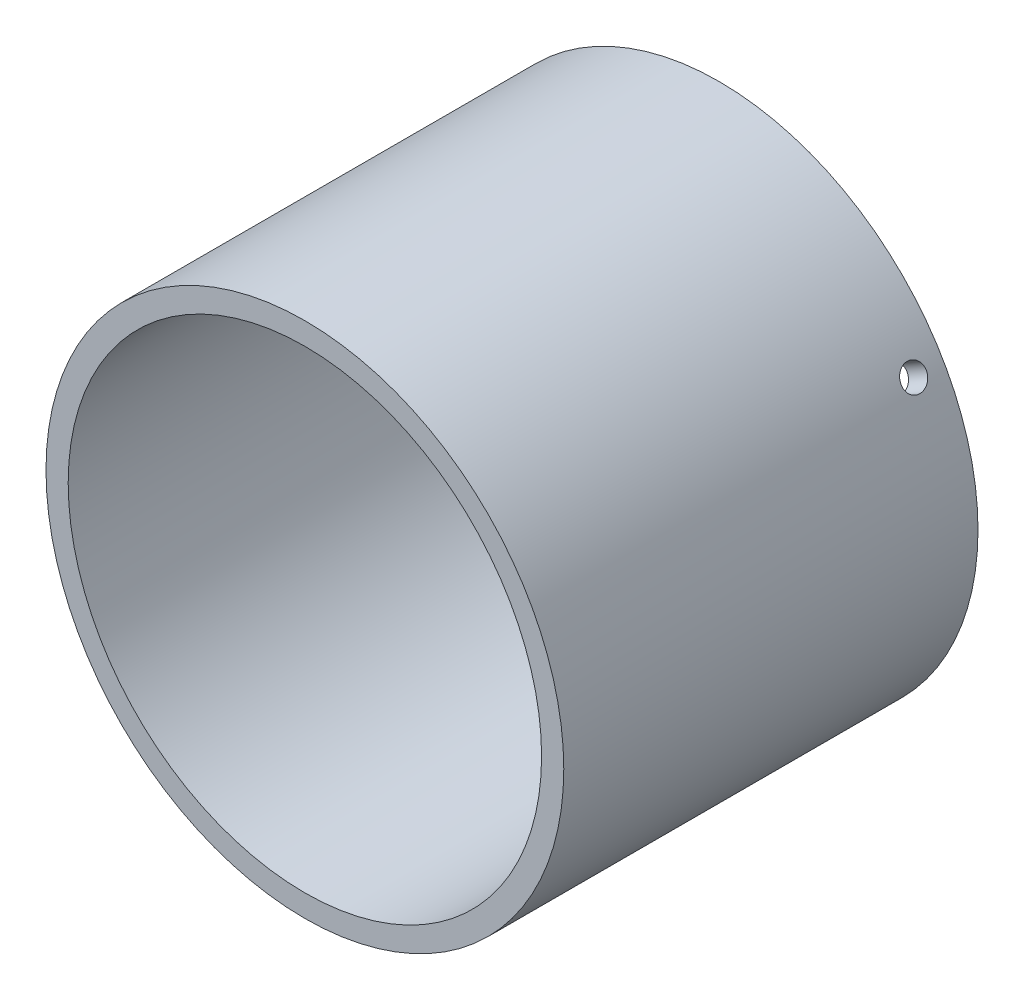
ISO-10303-21;
HEADER;
FILE_DESCRIPTION(('STEP AP214'),'2;1');
FILE_NAME('part.step','',(''),(''),'','','');
FILE_SCHEMA(('AUTOMOTIVE_DESIGN { 1 0 10303 214 1 1 1 1 }'));
ENDSEC;
DATA;
#1=APPLICATION_CONTEXT('core data for automotive mechanical design processes');
#2=APPLICATION_PROTOCOL_DEFINITION('international standard','automotive_design',2000,#1);
#3=PRODUCT_CONTEXT('',#1,'mechanical');
#4=PRODUCT('Part','Part','',(#3));
#5=PRODUCT_RELATED_PRODUCT_CATEGORY('part','',(#4));
#6=PRODUCT_DEFINITION_FORMATION('','',#4);
#7=PRODUCT_DEFINITION_CONTEXT('part definition',#1,'design');
#8=PRODUCT_DEFINITION('design','',#6,#7);
#9=PRODUCT_DEFINITION_SHAPE('','',#8);
#10=(LENGTH_UNIT() NAMED_UNIT(*) SI_UNIT(.MILLI.,.METRE.));
#11=(NAMED_UNIT(*) PLANE_ANGLE_UNIT() SI_UNIT($,.RADIAN.));
#12=(NAMED_UNIT(*) SI_UNIT($,.STERADIAN.) SOLID_ANGLE_UNIT());
#13=UNCERTAINTY_MEASURE_WITH_UNIT(LENGTH_MEASURE(1.E-05),#10,'distance_accuracy_value','');
#14=(GEOMETRIC_REPRESENTATION_CONTEXT(3) GLOBAL_UNCERTAINTY_ASSIGNED_CONTEXT((#13)) GLOBAL_UNIT_ASSIGNED_CONTEXT((#10,
#11,#12)) REPRESENTATION_CONTEXT('',''));
#15=CARTESIAN_POINT('',(0.,0.,0.));
#16=DIRECTION('',(0.,0.,1.));
#17=DIRECTION('',(1.,0.,0.));
#18=AXIS2_PLACEMENT_3D('',#15,#16,#17);
#19=CARTESIAN_POINT('',(0.,0.,56.));
#20=DIRECTION('',(0.,0.,1.));
#21=DIRECTION('',(1.,0.,0.));
#22=AXIS2_PLACEMENT_3D('',#19,#20,#21);
#23=PLANE('',#22);
#24=CARTESIAN_POINT('',(0.,0.,56.));
#25=DIRECTION('',(0.,0.,1.));
#26=DIRECTION('',(1.,0.,0.));
#27=AXIS2_PLACEMENT_3D('',#24,#25,#26);
#28=CIRCLE('',#27,35.);
#29=CARTESIAN_POINT('',(35.,0.,56.));
#30=VERTEX_POINT('',#29);
#31=EDGE_CURVE('E10',#30,#30,#28,.T.);
#32=ORIENTED_EDGE('',*,*,#31,.T.);
#33=EDGE_LOOP('',(#32));
#34=FACE_BOUND('',#33,.T.);
#35=CARTESIAN_POINT('',(0.,0.,56.));
#36=DIRECTION('',(0.,0.,1.));
#37=DIRECTION('',(1.,0.,0.));
#38=AXIS2_PLACEMENT_3D('',#35,#36,#37);
#39=CIRCLE('',#38,32.);
#40=CARTESIAN_POINT('',(32.,0.,56.));
#41=VERTEX_POINT('',#40);
#42=EDGE_CURVE('E46',#41,#41,#39,.T.);
#43=ORIENTED_EDGE('',*,*,#42,.F.);
#44=EDGE_LOOP('',(#43));
#45=FACE_BOUND('',#44,.T.);
#46=ADVANCED_FACE('F28',(#34,#45),#23,.T.);
#47=CARTESIAN_POINT('',(0.,0.,0.));
#48=DIRECTION('',(0.,0.,1.));
#49=DIRECTION('',(1.,0.,0.));
#50=AXIS2_PLACEMENT_3D('',#47,#48,#49);
#51=PLANE('',#50);
#52=CARTESIAN_POINT('',(0.,0.,0.));
#53=DIRECTION('',(0.,0.,1.));
#54=DIRECTION('',(1.,0.,0.));
#55=AXIS2_PLACEMENT_3D('',#52,#53,#54);
#56=CIRCLE('',#55,35.);
#57=CARTESIAN_POINT('',(35.,0.,0.));
#58=VERTEX_POINT('',#57);
#59=EDGE_CURVE('E41',#58,#58,#56,.T.);
#60=ORIENTED_EDGE('',*,*,#59,.F.);
#61=EDGE_LOOP('',(#60));
#62=FACE_BOUND('',#61,.T.);
#63=CARTESIAN_POINT('',(0.,0.,0.));
#64=DIRECTION('',(0.,0.,1.));
#65=DIRECTION('',(1.,0.,0.));
#66=AXIS2_PLACEMENT_3D('',#63,#64,#65);
#67=CIRCLE('',#66,32.);
#68=CARTESIAN_POINT('',(32.,0.,0.));
#69=VERTEX_POINT('',#68);
#70=EDGE_CURVE('E78',#69,#69,#67,.T.);
#71=ORIENTED_EDGE('',*,*,#70,.T.);
#72=EDGE_LOOP('',(#71));
#73=FACE_BOUND('',#72,.T.);
#74=ADVANCED_FACE('F89',(#62,#73),#51,.F.);
#75=CARTESIAN_POINT('',(0.,0.,56.));
#76=DIRECTION('',(0.,0.,-1.));
#77=DIRECTION('',(-1.,0.,0.));
#78=AXIS2_PLACEMENT_3D('',#75,#76,#77);
#79=CYLINDRICAL_SURFACE('',#78,35.);
#80=CARTESIAN_POINT('',(-29.4251135423138,18.9515881398351,3.99999999999999));
#81=CARTESIAN_POINT('',(-29.4251161295193,18.9515847689602,4.09542929950424));
#82=CARTESIAN_POINT('',(-29.4294867569684,18.9448034103171,4.19092636053496));
#83=CARTESIAN_POINT('',(-29.4468320161516,18.9178310435816,4.37928629635832));
#84=CARTESIAN_POINT('',(-29.4598167978485,18.8976242163654,4.47214592873519));
#85=CARTESIAN_POINT('',(-29.4939339353847,18.8443322046977,4.65247515129346));
#86=CARTESIAN_POINT('',(-29.5150621525123,18.8112535619652,4.73994745331193));
#87=CARTESIAN_POINT('',(-29.5647318090662,18.7330928228573,4.90704471580572));
#88=CARTESIAN_POINT('',(-29.5932714933423,18.6880135683491,4.98667152806437));
#89=CARTESIAN_POINT('',(-29.6568258035567,18.5869910633424,5.13591798592019));
#90=CARTESIAN_POINT('',(-29.6918458601599,18.5310386990014,5.20552915061215));
#91=CARTESIAN_POINT('',(-29.7671833827968,18.4097766884952,5.332696048194));
#92=CARTESIAN_POINT('',(-29.8075010644864,18.3444666613886,5.39025129006376));
#93=CARTESIAN_POINT('',(-29.8921470983969,18.2062106130465,5.49169537923105));
#94=CARTESIAN_POINT('',(-29.9364773523257,18.133260968513,5.53557770219226));
#95=CARTESIAN_POINT('',(-30.0277345790903,17.9817398960327,5.60838839802427));
#96=CARTESIAN_POINT('',(-30.0746615330862,17.9031685088725,5.6373168793747));
#97=CARTESIAN_POINT('',(-30.1696417211439,17.7426436634622,5.67937653954472));
#98=CARTESIAN_POINT('',(-30.2176940279789,17.6606929499696,5.6925202874632));
#99=CARTESIAN_POINT('',(-30.3135481406104,17.4956538671794,5.70267616375891));
#100=CARTESIAN_POINT('',(-30.3613499482898,17.4125655064511,5.69968841357984));
#101=CARTESIAN_POINT('',(-30.4553147096301,17.2476898285562,5.67767654500143));
#102=CARTESIAN_POINT('',(-30.5014790118324,17.1659014729429,5.65866595724484));
#103=CARTESIAN_POINT('',(-30.590968822413,17.0059117306484,5.60516902599532));
#104=CARTESIAN_POINT('',(-30.6342943193822,16.9277103583835,5.57068262031015));
#105=CARTESIAN_POINT('',(-30.717012763478,16.7771426932665,5.48719755887756));
#106=CARTESIAN_POINT('',(-30.7564040296294,16.7047788971478,5.43819273502778));
#107=CARTESIAN_POINT('',(-30.8302702925151,16.5680560578535,5.32706641326686));
#108=CARTESIAN_POINT('',(-30.8647452565939,16.5036970678484,5.26494482823714));
#109=CARTESIAN_POINT('',(-30.9280067846617,16.3848388557135,5.12927188813681));
#110=CARTESIAN_POINT('',(-30.9567874366723,16.3303498857932,5.05570879422109));
#111=CARTESIAN_POINT('',(-31.0079693262491,16.2329564469657,4.89928227457948));
#112=CARTESIAN_POINT('',(-31.0303705621904,16.1900519810094,4.81641884648467));
#113=CARTESIAN_POINT('',(-31.0683073306772,16.1171330396388,4.64373674526934));
#114=CARTESIAN_POINT('',(-31.0838426564224,16.0871189524819,4.55391786274715));
#115=CARTESIAN_POINT('',(-31.1077166696193,16.0409053971221,4.36987768756699));
#116=CARTESIAN_POINT('',(-31.1160554081505,16.0247058308677,4.27565642616089));
#117=CARTESIAN_POINT('',(-31.1253571715627,16.0066313263189,4.0855891701998));
#118=CARTESIAN_POINT('',(-31.1263277234367,16.0047417695967,3.98974493397244));
#119=CARTESIAN_POINT('',(-31.1208928212163,16.0153071760234,3.79906179049974));
#120=CARTESIAN_POINT('',(-31.1144873901166,16.0277620944534,3.7042228801212));
#121=CARTESIAN_POINT('',(-31.0944388606566,16.0666220674342,3.51828862223934));
#122=CARTESIAN_POINT('',(-31.0807992255448,16.0930204467723,3.42719150588277));
#123=CARTESIAN_POINT('',(-31.0465717370904,16.1589527840671,3.25127227349901));
#124=CARTESIAN_POINT('',(-31.0259838458351,16.1984868136974,3.16645019171414));
#125=CARTESIAN_POINT('',(-30.9782833616516,16.2895240218102,3.00541324891204));
#126=CARTESIAN_POINT('',(-30.9511654851112,16.3410368915773,2.92920543171134));
#127=CARTESIAN_POINT('',(-30.8910161531796,16.4544592965251,2.78763112351795));
#128=CARTESIAN_POINT('',(-30.8579846619868,16.5163688946484,2.72226469816452));
#129=CARTESIAN_POINT('',(-30.7867409634377,16.6487905735653,2.60417352871423));
#130=CARTESIAN_POINT('',(-30.7485244510564,16.7193097978444,2.55145939136334));
#131=CARTESIAN_POINT('',(-30.6678567351576,16.8668201071156,2.46024166638736));
#132=CARTESIAN_POINT('',(-30.6254055492954,16.943811165125,2.42173801951878));
#133=CARTESIAN_POINT('',(-30.5373661734603,17.1019720568498,2.36005280717796));
#134=CARTESIAN_POINT('',(-30.4917793841679,17.183140020704,2.33686444878646));
#135=CARTESIAN_POINT('',(-30.3986668854763,17.3473327980105,2.30644579812189));
#136=CARTESIAN_POINT('',(-30.3511411862041,17.4303576017635,2.29921542251108));
#137=CARTESIAN_POINT('',(-30.2555267779054,17.5958011698898,2.30091878498576));
#138=CARTESIAN_POINT('',(-30.2074386992385,17.6782204704287,2.30983588073879));
#139=CARTESIAN_POINT('',(-30.1120484792161,17.8402179317401,2.34354667170809));
#140=CARTESIAN_POINT('',(-30.0647463393494,17.919796087131,2.36834039699602));
#141=CARTESIAN_POINT('',(-29.9723545899891,18.0739049173578,2.43309728838201));
#142=CARTESIAN_POINT('',(-29.9272649992459,18.1484355494202,2.47306058301057));
#143=CARTESIAN_POINT('',(-29.8407057196631,18.2904128976407,2.56701921318819));
#144=CARTESIAN_POINT('',(-29.7992359180229,18.3578598345558,2.62101411127281));
#145=CARTESIAN_POINT('',(-29.7212094039953,18.4839179278283,2.74156244739717));
#146=CARTESIAN_POINT('',(-29.6846572532244,18.5425208865542,2.80812740975942));
#147=CARTESIAN_POINT('',(-29.6177089324535,18.64927074529,2.95192021670351));
#148=CARTESIAN_POINT('',(-29.5873142801093,18.6974150677415,3.02915068217299));
#149=CARTESIAN_POINT('',(-29.5336943897646,18.7819970657833,3.19214025408662));
#150=CARTESIAN_POINT('',(-29.5104758603398,18.8184237885021,3.27790724246493));
#151=CARTESIAN_POINT('',(-29.4720683285117,18.8785188071045,3.45541433761338));
#152=CARTESIAN_POINT('',(-29.4568698340926,18.9022021858758,3.54714723834309));
#153=CARTESIAN_POINT('',(-29.4390233600274,18.9299776881376,3.69954244611427));
#154=CARTESIAN_POINT('',(-29.433815090691,18.9380720025275,3.75921746596675));
#155=CARTESIAN_POINT('',(-29.4268593646416,18.9488782927464,3.87925261298606));
#156=CARTESIAN_POINT('',(-29.4251119051411,18.9515902729106,3.93961273960102));
#157=CARTESIAN_POINT('',(-29.4251135423138,18.9515881398351,3.99999999999999));
#158=B_SPLINE_CURVE_WITH_KNOTS('',3,(#80,#81,#82,#83,#84,#85,#86,#87,#88,#89,#90,#91,#92,#93,
#94,#95,#96,#97,#98,#99,#100,#101,#102,#103,#104,#105,#106,#107,#108,#109,#110,#111,#112,#113,
#114,#115,#116,#117,#118,#119,#120,#121,#122,#123,#124,#125,#126,#127,#128,#129,#130,#131,#132,
#133,#134,#135,#136,#137,#138,#139,#140,#141,#142,#143,#144,#145,#146,#147,#148,#149,#150,#151,
#152,#153,#154,#155,#156,#157),.UNSPECIFIED.,.T.,.F.,(4,2,2,2,2,2,2,2,2,2,2,2,2,2,2,2,2,2,2,2,2,
2,2,2,2,2,2,2,2,2,2,2,2,2,2,2,2,2,4),(0.,0.286067463119097,0.572472596475747,0.858732362610931,
1.14492439972246,1.43135736589339,1.71780199579334,2.00438310051121,2.29096212625491,
2.5773128026533,2.86366132330408,3.14976827612554,3.43587637872739,3.72210620815243,
4.00833793871138,4.29486530060146,4.58139273547376,4.86792879992848,5.15446283061314,
5.44070411216966,5.72694450136693,6.01304798151191,6.29915302278352,6.58549034294998,
6.87182939668354,7.15840766405092,7.44498473666101,7.73143461580975,8.01788299902108,
8.30403632326206,8.59019018950274,8.87634648035557,9.16249385076078,9.44890484805352,
9.73538635221262,10.0221348682386,10.3085432409842,10.4895656773952,10.6705879679997),.UNSPECIFIED.);
#159=CARTESIAN_POINT('',(-29.4251135423138,18.9515881398351,3.99999999999999));
#160=VERTEX_POINT('',#159);
#161=EDGE_CURVE('E56',#160,#160,#158,.T.);
#162=ORIENTED_EDGE('',*,*,#161,.T.);
#163=EDGE_LOOP('',(#162));
#164=FACE_BOUND('',#163,.T.);
#165=CARTESIAN_POINT('',(31.1251135423141,16.0071017669676,4.));
#166=CARTESIAN_POINT('',(31.1251119166535,16.0071056929908,4.09542929950425));
#167=CARTESIAN_POINT('',(31.121424401521,16.0142814467137,4.19092636053496));
#168=CARTESIAN_POINT('',(31.1067382763194,16.0427890651693,4.37928629635832));
#169=CARTESIAN_POINT('',(31.0957310414687,16.0641376295895,4.4721459287352));
#170=CARTESIAN_POINT('',(31.0666373743138,16.1203299432341,4.65247515129347));
#171=CARTESIAN_POINT('',(31.0485545379486,16.1551668373695,4.73994745331194));
#172=CARTESIAN_POINT('',(31.0057001805795,16.2372623912965,4.90704471580572));
#173=CARTESIAN_POINT('',(30.9809302431299,16.2845181101497,4.98667152806437));
#174=CARTESIAN_POINT('',(30.9252193425473,16.3900690098187,5.13591798592019));
#175=CARTESIAN_POINT('',(30.8942732019277,16.4483734506495,5.20552915061217));
#176=CARTESIAN_POINT('',(30.8269259816339,16.5742486643643,5.33269604819403));
#177=CARTESIAN_POINT('',(30.7905246798825,16.6418198144825,5.39025129006378));
#178=CARTESIAN_POINT('',(30.7131144467467,16.7842534543497,5.49169537923105));
#179=CARTESIAN_POINT('',(30.672103328348,16.8591194026749,5.53557770219227));
#180=CARTESIAN_POINT('',(30.5865108437537,17.0139110155721,5.60838839802427));
#181=CARTESIAN_POINT('',(30.5419295034603,17.0938366434349,5.6373168793747));
#182=CARTESIAN_POINT('',(30.4504010034253,17.2563543218542,5.67937653954473));
#183=CARTESIAN_POINT('',(30.4034557571,17.3389441970302,5.69252028746321));
#184=CARTESIAN_POINT('',(30.308454775102,17.5044758350213,5.70267616375892));
#185=CARTESIAN_POINT('',(30.2603990477923,17.5874175951827,5.69968841357984));
#186=CARTESIAN_POINT('',(30.1645949029393,17.7512313045114,5.67767654500143));
#187=CARTESIAN_POINT('',(30.1168462603456,17.8321049407732,5.65866595724485));
#188=CARTESIAN_POINT('',(30.0230359844639,17.989600261263,5.60516902599532));
#189=CARTESIAN_POINT('',(29.9769743579563,18.0662219284024,5.57068262031015));
#190=CARTESIAN_POINT('',(29.8879381570243,18.2131420349094,5.48719755887756));
#191=CARTESIAN_POINT('',(29.844964904347,18.2834377701431,5.4381927350278));
#192=CARTESIAN_POINT('',(29.7634925836834,18.4157692499319,5.32706641326689));
#193=CARTESIAN_POINT('',(29.7249935454165,18.4778049396212,5.26494482823715));
#194=CARTESIAN_POINT('',(29.6536900782933,18.5920201360776,5.12927188813682));
#195=CARTESIAN_POINT('',(29.6208915721214,18.6441893968164,5.0557087942211));
#196=CARTESIAN_POINT('',(29.5621373247233,18.7372109328174,4.89928227457949));
#197=CARTESIAN_POINT('',(29.53618158524,18.778063205197,4.81641884648469));
#198=CARTESIAN_POINT('',(29.4920003138394,18.8473768811293,4.64373674526936));
#199=CARTESIAN_POINT('',(29.4737750147627,18.8758379114591,4.55391786274716));
#200=CARTESIAN_POINT('',(29.4456899084204,18.9196201910578,4.369877687567));
#201=CARTESIAN_POINT('',(29.4358300417794,18.9349415335886,4.2756564261609));
#202=CARTESIAN_POINT('',(29.4248279433855,18.9520343492779,4.08558917019982));
#203=CARTESIAN_POINT('',(29.423676815199,18.9538196502176,3.98974493397245));
#204=CARTESIAN_POINT('',(29.4301092744557,18.9438301836142,3.79906179049975));
#205=CARTESIAN_POINT('',(29.4376928346683,18.9320554583448,3.70422288012122));
#206=CARTESIAN_POINT('',(29.4613222937301,18.8952629360335,3.51828862223935));
#207=CARTESIAN_POINT('',(29.4773641432997,18.8702514758592,3.42719150588278));
#208=CARTESIAN_POINT('',(29.5173494781006,18.8076434327026,3.25127227349902));
#209=CARTESIAN_POINT('',(29.5412930064468,18.7700467810501,3.16645019171414));
#210=CARTESIAN_POINT('',(29.5962832992704,18.6832183459179,3.00541324891204));
#211=CARTESIAN_POINT('',(29.6273358148403,18.6339771410537,2.92920543171135));
#212=CARTESIAN_POINT('',(29.6954878329177,18.5251750891063,2.78763112351797));
#213=CARTESIAN_POINT('',(29.7325873720341,18.4656141795468,2.72226469816454));
#214=CARTESIAN_POINT('',(29.8116460607134,18.3377044872853,2.60417352871425));
#215=CARTESIAN_POINT('',(29.8536092442036,18.2693484045795,2.55145939136335));
#216=CARTESIAN_POINT('',(29.9410230614032,18.1257329587103,2.46024166638736));
#217=CARTESIAN_POINT('',(29.9864736805725,18.0504736243282,2.42173801951879));
#218=CARTESIAN_POINT('',(30.0794253427738,17.8951488424592,2.36005280717798));
#219=CARTESIAN_POINT('',(30.1269254667988,17.8150855429279,2.33686444878647));
#220=CARTESIAN_POINT('',(30.2225643337183,17.6523513649979,2.30644579812189));
#221=CARTESIAN_POINT('',(30.2707030732765,17.569680500219,2.29921542251108));
#222=CARTESIAN_POINT('',(30.3661742020172,17.4041542096014,2.30091878498576));
#223=CARTESIAN_POINT('',(30.4135073707126,17.3212990615872,2.3098358807388));
#224=CARTESIAN_POINT('',(30.5061061775457,17.1576899771196,2.34354667170811));
#225=CARTESIAN_POINT('',(30.5513718117672,17.0769360446462,2.36834039699604));
#226=CARTESIAN_POINT('',(30.638638099011,16.9198680274867,2.43309728838202));
#227=CARTESIAN_POINT('',(30.6806387243655,16.8435539804257,2.47306058301058));
#228=CARTESIAN_POINT('',(30.760315074895,16.6976027712634,2.56701921318819));
#229=CARTESIAN_POINT('',(30.7979909348508,16.6279654010955,2.62101411127281));
#230=CARTESIAN_POINT('',(30.8681471889637,16.4973634111426,2.74156244739717));
#231=CARTESIAN_POINT('',(30.9006227645717,16.4364068406492,2.80812740975942));
#232=CARTESIAN_POINT('',(30.9595966937019,16.3250529647529,2.95192021670351));
#233=CARTESIAN_POINT('',(30.9860935738208,16.2746582624579,3.029150682173));
#234=CARTESIAN_POINT('',(31.0325337876555,16.1859310762504,3.19214025408663));
#235=CARTESIAN_POINT('',(31.0524709901942,16.1476098785706,3.27790724246494));
#236=CARTESIAN_POINT('',(31.0853110370307,16.0843004710096,3.45541433761339));
#237=CARTESIAN_POINT('',(31.0982221974846,16.0592964993576,3.5471472383431));
#238=CARTESIAN_POINT('',(31.1133532510136,16.0299532483183,3.69954244611429));
#239=CARTESIAN_POINT('',(31.1177589982332,16.0213955975683,3.75921746596677));
#240=CARTESIAN_POINT('',(31.1236396570587,16.0099686169983,3.87925261298608));
#241=CARTESIAN_POINT('',(31.1251145710253,16.0070992825966,3.93961273960103));
#242=CARTESIAN_POINT('',(31.1251135423141,16.0071017669676,4.));
#243=B_SPLINE_CURVE_WITH_KNOTS('',3,(#165,#166,#167,#168,#169,#170,#171,#172,#173,#174,#175,
#176,#177,#178,#179,#180,#181,#182,#183,#184,#185,#186,#187,#188,#189,#190,#191,#192,#193,#194,
#195,#196,#197,#198,#199,#200,#201,#202,#203,#204,#205,#206,#207,#208,#209,#210,#211,#212,#213,
#214,#215,#216,#217,#218,#219,#220,#221,#222,#223,#224,#225,#226,#227,#228,#229,#230,#231,#232,
#233,#234,#235,#236,#237,#238,#239,#240,#241,#242),.UNSPECIFIED.,.T.,.F.,(4,2,2,2,2,2,2,2,2,2,2,
2,2,2,2,2,2,2,2,2,2,2,2,2,2,2,2,2,2,2,2,2,2,2,2,2,2,2,4),(0.,0.286067463119089,
0.572472596475728,0.858732362610923,1.14492439972247,1.43135736589341,1.71780199579335,
2.00438310051119,2.29096212625486,2.57731280265329,2.86366132330411,3.14976827612556,
3.4358763787274,3.72210620815241,4.00833793871134,4.29486530060145,4.58139273547377,
4.86792879992848,5.15446283061314,5.44070411216965,5.72694450136692,6.01304798151191,
6.29915302278351,6.58549034294998,6.87182939668357,7.15840766405094,7.44498473666103,
7.73143461580977,8.01788299902111,8.30403632326205,8.59019018950271,8.87634648035556,
9.16249385076078,9.4489048480535,9.7353863522126,10.0221348682386,10.3085432409842,
10.4895656773952,10.6705879679997),.UNSPECIFIED.);
#244=CARTESIAN_POINT('',(31.1251135423141,16.0071017669676,4.));
#245=VERTEX_POINT('',#244);
#246=EDGE_CURVE('E118',#245,#245,#243,.T.);
#247=ORIENTED_EDGE('',*,*,#246,.T.);
#248=EDGE_LOOP('',(#247));
#249=FACE_BOUND('',#248,.T.);
#250=CARTESIAN_POINT('',(0.,-35.,5.7));
#251=CARTESIAN_POINT('',(0.0954293743822743,-34.9999994472995,5.69999578720194));
#252=CARTESIAN_POINT('',(0.190926510035618,-34.9996055294314,5.69193763240269));
#253=CARTESIAN_POINT('',(0.379286600913754,-34.9980719825392,5.65990619507327));
#254=CARTESIAN_POINT('',(0.472146313781193,-34.9969314738498,5.63591413805218));
#255=CARTESIAN_POINT('',(0.652475706480711,-34.9940338381992,5.5727032149443));
#256=CARTESIAN_POINT('',(0.739948097468028,-34.9922770244224,5.53349208157708));
#257=CARTESIAN_POINT('',(0.907045508807625,-34.9883446651304,5.44096787960112));
#258=CARTESIAN_POINT('',(0.986672381056032,-34.9861692187912,5.38765814989504));
#259=CARTESIAN_POINT('',(1.13591877025078,-34.9816420005491,5.26839283040727));
#260=CARTESIAN_POINT('',(1.20552982551339,-34.9792900820793,5.20242665655972));
#261=CARTESIAN_POINT('',(1.33269651215855,-34.9746762605858,5.05974200620119));
#262=CARTESIAN_POINT('',(1.39025165218579,-34.972414361234,4.98302309166019));
#263=CARTESIAN_POINT('',(1.49169563557403,-34.9682346194601,4.82096688406568));
#264=CARTESIAN_POINT('',(1.53557793569386,-34.9663169419534,4.73562549045032));
#265=CARTESIAN_POINT('',(1.60838858341058,-34.9630436624259,4.55877573279998));
#266=CARTESIAN_POINT('',(1.6373170397641,-34.9616880563173,4.46726741362141));
#267=CARTESIAN_POINT('',(1.67937664663565,-34.9596931012606,4.28075865304517));
#268=CARTESIAN_POINT('',(1.69252036443051,-34.9590531825345,4.18576105188712));
#269=CARTESIAN_POINT('',(1.70267616385266,-34.9585600529689,3.99490586355473));
#270=CARTESIAN_POINT('',(1.69968836724156,-34.9587068361914,3.89904828287701));
#271=CARTESIAN_POINT('',(1.67767642592836,-34.9597700283578,3.70927958354419));
#272=CARTESIAN_POINT('',(1.65866585858751,-34.9606857856866,3.61536688584667));
#273=CARTESIAN_POINT('',(1.60516905412589,-34.9631826833522,3.43206728306681));
#274=CARTESIAN_POINT('',(1.57068275435799,-34.9647638263826,3.34268039630698));
#275=CARTESIAN_POINT('',(1.48719791062039,-34.9684140352849,3.17092603520013));
#276=CARTESIAN_POINT('',(1.43819317356951,-34.9704833093003,3.08856157573386));
#277=CARTESIAN_POINT('',(1.32706703620335,-34.9748763365045,2.93322307394442));
#278=CARTESIAN_POINT('',(1.26494554882378,-34.9772000913824,2.86024909395706));
#279=CARTESIAN_POINT('',(1.12927267703632,-34.9818430629447,2.72568398556418));
#280=CARTESIAN_POINT('',(1.05570953409285,-34.9841622724468,2.66410471161981));
#281=CARTESIAN_POINT('',(0.899282875460667,-34.9885324354395,2.55416836458124));
#282=CARTESIAN_POINT('',(0.816419357566344,-34.9905833888663,2.50581129462273));
#283=CARTESIAN_POINT('',(0.64373723406546,-34.9941859736703,2.42369318707466));
#284=CARTESIAN_POINT('',(0.553918433129656,-34.9957375910179,2.38993255958086));
#285=CARTESIAN_POINT('',(0.369878434979043,-34.9981664246005,2.3379734096073));
#286=CARTESIAN_POINT('',(0.275657268879444,-34.9990436456013,2.31977477715539));
#287=CARTESIAN_POINT('',(0.08559005399087,-35.0000242080894,2.29947081278432));
#288=CARTESIAN_POINT('',(-0.0102542392489384,-35.0001283380813,2.29734908338549));
#289=CARTESIAN_POINT('',(-0.200937508670877,-34.9995530758056,2.30921636654421));
#290=CARTESIAN_POINT('',(-0.295776487986462,-34.9988736859809,2.32320532887155));
#291=CARTESIAN_POINT('',(-0.48171107228816,-34.9968084172084,2.3668833285713));
#292=CARTESIAN_POINT('',(-0.572808439263788,-34.9954228750191,2.3965648825203));
#293=CARTESIAN_POINT('',(-0.74872814215051,-34.992101306553,2.47077792844908));
#294=CARTESIAN_POINT('',(-0.833550443990365,-34.9901652772875,2.51530950105164));
#295=CARTESIAN_POINT('',(-0.994587531685297,-34.9859585905163,2.61800050038545));
#296=CARTESIAN_POINT('',(-1.07079529855487,-34.9836876635639,2.67617092289086));
#297=CARTESIAN_POINT('',(-1.21236949099692,-34.9790678464208,2.80447230528179));
#298=CARTESIAN_POINT('',(-1.27773585071559,-34.9767189557566,2.8746033378142));
#299=CARTESIAN_POINT('',(-1.39582688550679,-34.9722057130034,3.02490569536923));
#300=CARTESIAN_POINT('',(-1.4485409540428,-34.9700415167179,3.10508535915059));
#301=CARTESIAN_POINT('',(-1.53975855812572,-34.9661441530493,3.27316681039784));
#302=CARTESIAN_POINT('',(-1.57826215291306,-34.9644109838693,3.36106856567009));
#303=CARTESIAN_POINT('',(-1.63994732919217,-34.961572224974,3.5420596409462));
#304=CARTESIAN_POINT('',(-1.66313568108114,-34.9604663579783,3.63514664894854));
#305=CARTESIAN_POINT('',(-1.69355428663164,-34.9590061262685,3.82389821367127));
#306=CARTESIAN_POINT('',(-1.70078462413204,-34.9586517576062,3.91956275684736));
#307=CARTESIAN_POINT('',(-1.69908115355434,-34.9587345829485,4.11064822269173));
#308=CARTESIAN_POINT('',(-1.69016403316241,-34.9591709597527,4.20606929493125));
#309=CARTESIAN_POINT('',(-1.65645325466718,-34.9607843658987,4.39405796557313));
#310=CARTESIAN_POINT('',(-1.63165956617799,-34.9619613966581,4.48662555851391));
#311=CARTESIAN_POINT('',(-1.56690281332374,-34.9649232665694,4.66628324292673));
#312=CARTESIAN_POINT('',(-1.52693962049794,-34.9667081108686,4.75337328800569));
#313=CARTESIAN_POINT('',(-1.43298124661545,-34.9706843803893,4.91960861878185));
#314=CARTESIAN_POINT('',(-1.37898650283839,-34.9728757929399,4.99875415195551));
#315=CARTESIAN_POINT('',(-1.25843833301718,-34.9774207769775,5.14693693574019));
#316=CARTESIAN_POINT('',(-1.19187334760789,-34.9797744964441,5.21596477770322));
#317=CARTESIAN_POINT('',(-1.04808044749529,-34.9843778030766,5.34188725000349));
#318=CARTESIAN_POINT('',(-0.970849912154561,-34.9866273644679,5.39877888957914));
#319=CARTESIAN_POINT('',(-0.807860286807723,-34.990770343833,5.49883910515793));
#320=CARTESIAN_POINT('',(-0.722093327302723,-34.9926634284442,5.54199486168923));
#321=CARTESIAN_POINT('',(-0.544586294063647,-34.9958750819141,5.61324249435999));
#322=CARTESIAN_POINT('',(-0.452853426208433,-34.9971943295896,5.64135217828619));
#323=CARTESIAN_POINT('',(-0.300458140317944,-34.9987603966133,5.67432979024126));
#324=CARTESIAN_POINT('',(-0.240783003512232,-34.9992232072612,5.68394384469237));
#325=CARTESIAN_POINT('',(-0.12074762201948,-34.9998431837055,5.69678027992986));
#326=CARTESIAN_POINT('',(-0.0603873778821156,-35.000000349747,5.70000266584403));
#327=CARTESIAN_POINT('',(0.,-35.,5.7));
#328=B_SPLINE_CURVE_WITH_KNOTS('',3,(#250,#251,#252,#253,#254,#255,#256,#257,#258,#259,#260,
#261,#262,#263,#264,#265,#266,#267,#268,#269,#270,#271,#272,#273,#274,#275,#276,#277,#278,#279,
#280,#281,#282,#283,#284,#285,#286,#287,#288,#289,#290,#291,#292,#293,#294,#295,#296,#297,#298,
#299,#300,#301,#302,#303,#304,#305,#306,#307,#308,#309,#310,#311,#312,#313,#314,#315,#316,#317,
#318,#319,#320,#321,#322,#323,#324,#325,#326,#327),.UNSPECIFIED.,.T.,.F.,(4,2,2,2,2,2,2,2,2,2,2,
2,2,2,2,2,2,2,2,2,2,2,2,2,2,2,2,2,2,2,2,2,2,2,2,2,2,2,4),(0.,0.286067687995398,0.57247304132645,
0.858733063947017,1.14492535359925,1.43135802560014,1.71780236928562,2.00438358328462,
2.29096271300034,2.57731352648676,2.86366217858344,3.14976842848364,3.43587583657765,
3.72210546470313,4.00833699277805,4.29486464734991,4.58139236987288,4.86792814204014,
5.15446188932472,5.44070334993387,5.72694391809647,6.01304810790402,6.29915385103555,
6.58549105340195,6.87182999499825,7.15840814536849,7.4449851010423,7.73143528492444,
8.01788396387534,8.30403677966834,8.59019014312579,8.87634592988523,9.16249279994735,
9.44890409824575,9.73538589643007,10.0221342846274,10.3085425369651,10.4895653252384,
10.6705879682836),.UNSPECIFIED.);
#329=CARTESIAN_POINT('',(0.,-35.,5.7));
#330=VERTEX_POINT('',#329);
#331=EDGE_CURVE('E55',#330,#330,#328,.T.);
#332=ORIENTED_EDGE('',*,*,#331,.T.);
#333=EDGE_LOOP('',(#332));
#334=FACE_BOUND('',#333,.T.);
#335=ORIENTED_EDGE('',*,*,#31,.F.);
#336=EDGE_LOOP('',(#335));
#337=FACE_BOUND('',#336,.T.);
#338=ORIENTED_EDGE('',*,*,#59,.T.);
#339=EDGE_LOOP('',(#338));
#340=FACE_BOUND('',#339,.T.);
#341=ADVANCED_FACE('F30',(#164,#249,#334,#337,#340),#79,.T.);
#342=CARTESIAN_POINT('',(0.,0.,56.));
#343=DIRECTION('',(0.,0.,-1.));
#344=DIRECTION('',(-1.,0.,0.));
#345=AXIS2_PLACEMENT_3D('',#342,#343,#344);
#346=CYLINDRICAL_SURFACE('',#345,32.);
#347=CARTESIAN_POINT('',(-26.823678830253,17.4496491085476,3.99999999999999));
#348=CARTESIAN_POINT('',(-26.8236814596271,17.4496457672528,4.09541742990473));
#349=CARTESIAN_POINT('',(-26.8280831049577,17.4428846218098,4.1909023311868));
#350=CARTESIAN_POINT('',(-26.8455487672461,17.415991460344,4.37923746764485));
#351=CARTESIAN_POINT('',(-26.8586229622547,17.3958437338664,4.47208447332905));
#352=CARTESIAN_POINT('',(-26.8929662888946,17.3427033425647,4.65238837721729));
#353=CARTESIAN_POINT('',(-26.9142312089681,17.3097172789454,4.73984801876618));
#354=CARTESIAN_POINT('',(-26.964205520174,17.2317658338262,4.90692246559804));
#355=CARTESIAN_POINT('',(-26.9929131660998,17.1868032605689,4.98653910391526));
#356=CARTESIAN_POINT('',(-27.0568201297115,17.0860187801411,5.13578058407221));
#357=CARTESIAN_POINT('',(-27.0920258242513,17.0301862027266,5.20539549032864));
#358=CARTESIAN_POINT('',(-27.1677276522331,16.9091589983663,5.33257259787607));
#359=CARTESIAN_POINT('',(-27.208224002587,16.8439639875589,5.39013430474554));
#360=CARTESIAN_POINT('',(-27.2932048392677,16.7059131237946,5.49159920418358));
#361=CARTESIAN_POINT('',(-27.3376916011012,16.6330528956507,5.53549453898681));
#362=CARTESIAN_POINT('',(-27.4292183995809,16.4816805168216,5.60833026774923));
#363=CARTESIAN_POINT('',(-27.4762584150675,16.4031684129737,5.63727078562292));
#364=CARTESIAN_POINT('',(-27.5714009136266,16.2427379528917,5.67934879368121));
#365=CARTESIAN_POINT('',(-27.6195023411365,16.1608229150745,5.69250132208711));
#366=CARTESIAN_POINT('',(-27.7153919561144,15.9958167276514,5.7026764162082));
#367=CARTESIAN_POINT('',(-27.7631801462884,15.912725588225,5.69969912144333));
#368=CARTESIAN_POINT('',(-27.8570480454092,15.7478210890998,5.67771154457849));
#369=CARTESIAN_POINT('',(-27.9031294299153,15.6660065244711,5.65871744631498));
#370=CARTESIAN_POINT('',(-27.9924009624333,15.505930889799,5.60526052891797));
#371=CARTESIAN_POINT('',(-28.035591097175,15.4276698360658,5.57079763879265));
#372=CARTESIAN_POINT('',(-28.118004876521,15.2769496736045,5.48736298888306));
#373=CARTESIAN_POINT('',(-28.1572264941523,15.2044935337077,5.43838386441814));
#374=CARTESIAN_POINT('',(-28.2307352021525,15.0675690940801,5.32731245661083));
#375=CARTESIAN_POINT('',(-28.2650222529282,15.0031008584421,5.26522006806201));
#376=CARTESIAN_POINT('',(-28.3279178264144,14.8840056125753,5.12959323623196));
#377=CARTESIAN_POINT('',(-28.3565192807617,14.8293908599429,5.05604475067401));
#378=CARTESIAN_POINT('',(-28.4073653746327,14.7317559181869,4.89964279618987));
#379=CARTESIAN_POINT('',(-28.4296100122976,14.6887357324538,4.81678932454281));
#380=CARTESIAN_POINT('',(-28.4672747592672,14.6156070053033,4.64412065913509));
#381=CARTESIAN_POINT('',(-28.4826946129178,14.5854989475712,4.55430520472899));
#382=CARTESIAN_POINT('',(-28.5063922207159,14.539129494384,4.37026602229717));
#383=CARTESIAN_POINT('',(-28.5146700355066,14.5228679813577,4.276042331709));
#384=CARTESIAN_POINT('',(-28.5239111300896,14.5047095718986,4.08598463760185));
#385=CARTESIAN_POINT('',(-28.524883336793,14.5027951443992,3.99015274281776));
#386=CARTESIAN_POINT('',(-28.5195173424136,14.5133443501104,3.79949057550066));
#387=CARTESIAN_POINT('',(-28.5131791686779,14.5258079295345,3.70466029922204));
#388=CARTESIAN_POINT('',(-28.4933254236848,14.5647134505803,3.5187485215956));
#389=CARTESIAN_POINT('',(-28.4798139705923,14.5911473718178,3.42766490159484));
#390=CARTESIAN_POINT('',(-28.4458907585525,14.6571712311696,3.25176667109492));
#391=CARTESIAN_POINT('',(-28.4254789544633,14.6967612553506,3.16695210161218));
#392=CARTESIAN_POINT('',(-28.3781567984071,14.7879290980901,3.0059091954272));
#393=CARTESIAN_POINT('',(-28.3512401578256,14.8395185153566,2.9296892729018));
#394=CARTESIAN_POINT('',(-28.2914995400519,14.9530986829627,2.78808393137655));
#395=CARTESIAN_POINT('',(-28.2586755205023,15.0150895078827,2.72269859006975));
#396=CARTESIAN_POINT('',(-28.1878247162205,15.1476791152014,2.60455236413275));
#397=CARTESIAN_POINT('',(-28.1497927593888,15.2182864471313,2.55180417470377));
#398=CARTESIAN_POINT('',(-28.0694555250927,15.3659598625462,2.46051638643227));
#399=CARTESIAN_POINT('',(-28.0271502680172,15.4430259152149,2.4219767198021));
#400=CARTESIAN_POINT('',(-27.939351623392,15.6013079647118,2.36022214932912));
#401=CARTESIAN_POINT('',(-27.8938599353833,15.6825217431071,2.33699914388728));
#402=CARTESIAN_POINT('',(-27.8008733127031,15.8467771457823,2.30651058457052));
#403=CARTESIAN_POINT('',(-27.7533783912615,15.9298187579888,2.299244925325));
#404=CARTESIAN_POINT('',(-27.6577680841107,16.0952471482297,2.30087830309385));
#405=CARTESIAN_POINT('',(-27.6096535348424,16.1776346069406,2.30975743754514));
#406=CARTESIAN_POINT('',(-27.5141472899659,16.3395390498715,2.34338718540624));
#407=CARTESIAN_POINT('',(-27.4667555957011,16.4190560287571,2.36813782830913));
#408=CARTESIAN_POINT('',(-27.374131915528,16.5730196407242,2.4328038276619));
#409=CARTESIAN_POINT('',(-27.3288999394416,16.6474662507472,2.47271925307134));
#410=CARTESIAN_POINT('',(-27.2420179584243,16.789263849378,2.56657852252247));
#411=CARTESIAN_POINT('',(-27.2003678475056,16.8566150479531,2.62052195128388));
#412=CARTESIAN_POINT('',(-27.1219534919422,16.9824955243487,2.74097794950051));
#413=CARTESIAN_POINT('',(-27.0851947808091,17.041014820742,2.80750455146546));
#414=CARTESIAN_POINT('',(-27.0178374206119,17.1476076525124,2.95122621860593));
#415=CARTESIAN_POINT('',(-26.9872402874994,17.1956786174856,3.02842390135992));
#416=CARTESIAN_POINT('',(-26.9332379293052,17.2801394132882,3.19136336277028));
#417=CARTESIAN_POINT('',(-26.9098400984092,17.316517236146,3.27711380684542));
#418=CARTESIAN_POINT('',(-26.87111942049,17.3765424915989,3.45459846264817));
#419=CARTESIAN_POINT('',(-26.8557870541623,17.4002049323004,3.54632547607825));
#420=CARTESIAN_POINT('',(-26.8377547545697,17.42799681517,3.69885035367918));
#421=CARTESIAN_POINT('',(-26.8324844341078,17.436106832158,3.75866072787417));
#422=CARTESIAN_POINT('',(-26.825445639691,17.4469340359848,3.87897168509684));
#423=CARTESIAN_POINT('',(-26.8236771623183,17.4496512280869,3.93947226745081));
#424=CARTESIAN_POINT('',(-26.823678830253,17.4496491085476,3.99999999999999));
#425=B_SPLINE_CURVE_WITH_KNOTS('',3,(#347,#348,#349,#350,#351,#352,#353,#354,#355,#356,#357,
#358,#359,#360,#361,#362,#363,#364,#365,#366,#367,#368,#369,#370,#371,#372,#373,#374,#375,#376,
#377,#378,#379,#380,#381,#382,#383,#384,#385,#386,#387,#388,#389,#390,#391,#392,#393,#394,#395,
#396,#397,#398,#399,#400,#401,#402,#403,#404,#405,#406,#407,#408,#409,#410,#411,#412,#413,#414,
#415,#416,#417,#418,#419,#420,#421,#422,#423,#424),.UNSPECIFIED.,.T.,.F.,(4,2,2,2,2,2,2,2,2,2,2,
2,2,2,2,2,2,2,2,2,2,2,2,2,2,2,2,2,2,2,2,2,2,2,2,2,2,2,4),(0.,0.286031336912108,
0.572398953754047,0.858619520459205,1.14477303337536,1.4312088704143,1.71765645473413,
2.00426843519173,2.29087804076548,2.57721443058232,2.8635483436472,3.14959328293356,
3.43563953499582,3.7218311591968,4.00802507957253,4.29457260266899,4.58112020955478,
4.86767854950892,5.15423445626886,5.4404401559396,5.72664478495237,6.01268528186855,
6.29872765009119,6.58504766667804,6.87136973633152,7.15797824835486,7.44458539297541,
7.73104081769514,8.01749435086772,8.30359499661129,8.58969617400007,8.87579865240626,
9.16189266209525,9.44830761967478,9.73479295892002,10.0215715639149,10.3080109332934,
10.4894541473465,10.6708971843114),.UNSPECIFIED.);
#426=CARTESIAN_POINT('',(-26.823678830253,17.4496491085476,3.99999999999999));
#427=VERTEX_POINT('',#426);
#428=EDGE_CURVE('E33',#427,#427,#425,.T.);
#429=ORIENTED_EDGE('',*,*,#428,.F.);
#430=EDGE_LOOP('',(#429));
#431=FACE_BOUND('',#430,.T.);
#432=CARTESIAN_POINT('',(28.5236788302533,14.5051627356801,4.));
#433=CARTESIAN_POINT('',(28.5236772512941,14.5051666834322,4.09541742990475));
#434=CARTESIAN_POINT('',(28.5200227502471,14.5123591928285,4.19090233118681));
#435=CARTESIAN_POINT('',(28.5054654203738,14.540931480797,4.37923746764486));
#436=CARTESIAN_POINT('',(28.4945540749201,14.5623279290473,4.47208447332905));
#437=CARTESIAN_POINT('',(28.4657048094057,14.6186403180188,4.65238837721729));
#438=CARTESIAN_POINT('',(28.4477705003773,14.6535493108215,4.73984801876619));
#439=CARTESIAN_POINT('',(28.4052497242453,14.7358040564221,4.90692246559806));
#440=CARTESIAN_POINT('',(28.3806648165479,14.7831468937053,4.98653910391527));
#441=CARTESIAN_POINT('',(28.325336377996,14.8888841878857,5.13578058407223));
#442=CARTESIAN_POINT('',(28.2945867948662,14.9472895024223,5.20539549032866));
#443=CARTESIAN_POINT('',(28.2276250753321,15.0733628107476,5.33257259787609));
#444=CARTESIAN_POINT('',(28.1914127149498,15.1410311843183,5.39013430474554));
#445=CARTESIAN_POINT('',(28.1143475782559,15.2836521796008,5.49159920418357));
#446=CARTESIAN_POINT('',(28.0734921506744,15.3586089595527,5.53549453898682));
#447=CARTESIAN_POINT('',(27.9881632244171,15.5135596815777,5.60833026774924));
#448=CARTESIAN_POINT('',(27.9436897557236,15.5935535819075,5.63727078562294));
#449=CARTESIAN_POINT('',(27.8523241510313,15.7561646326801,5.67934879368123));
#450=CARTESIAN_POINT('',(27.8054343610845,15.8387792097706,5.69250132208713));
#451=CARTESIAN_POINT('',(27.7104796184835,16.0043251460122,5.70267641620821));
#452=CARTESIAN_POINT('',(27.6624146759978,16.0872565024169,5.69969912144333));
#453=CARTESIAN_POINT('',(27.5665371401174,16.251000737218,5.67771154457849));
#454=CARTESIAN_POINT('',(27.5187243410025,16.3318156691562,5.658717446315));
#455=CARTESIAN_POINT('',(27.4247305411085,16.4891649014875,5.60526052891798));
#456=CARTESIAN_POINT('',(27.3785495478194,16.5656991822334,5.57079763879265));
#457=CARTESIAN_POINT('',(27.2892289479384,16.7124316899996,5.48736298888306));
#458=CARTESIAN_POINT('',(27.2460908989433,16.7826266771942,5.43838386441815));
#459=CARTESIAN_POINT('',(27.164265209827,16.9147493055355,5.32731245661084));
#460=CARTESIAN_POINT('',(27.1255776054151,16.9766768803471,5.26522006806201));
#461=CARTESIAN_POINT('',(27.0538858837677,17.0906936677052,5.12959323623196));
#462=CARTESIAN_POINT('',(27.0208888477403,17.1427706300714,5.05604475067403));
#463=CARTESIAN_POINT('',(26.961757554818,17.2356221099248,4.89964279618989));
#464=CARTESIAN_POINT('',(26.9356232999301,17.2763966241071,4.81678932454282));
#465=CARTESIAN_POINT('',(26.8911243379561,17.3455796153852,4.64412065913511));
#466=CARTESIAN_POINT('',(26.8727599219268,17.3739876292353,4.55430520472901));
#467=CARTESIAN_POINT('',(26.8444516014062,17.417695086191,4.3702660222972));
#468=CARTESIAN_POINT('',(26.8345076254167,17.4329946406007,4.27604233170902));
#469=CARTESIAN_POINT('',(26.8234025288243,17.4500768679979,4.08598463760185));
#470=CARTESIAN_POINT('',(26.8222306893279,17.4518760374505,3.99015274281777));
#471=CARTESIAN_POINT('',(26.8286835722738,17.4419543471458,3.79949057550066));
#472=CARTESIAN_POINT('',(26.8363082618094,17.430233537965,3.70466029922205));
#473=CARTESIAN_POINT('',(26.8600745588859,17.3935869299178,3.5187485215956));
#474=CARTESIAN_POINT('',(26.876211279653,17.3686687076789,3.42766490159482));
#475=CARTESIAN_POINT('',(26.9164280130876,17.3062784145986,3.25176667109491));
#476=CARTESIAN_POINT('',(26.9405080777203,17.2688062616297,3.16695210161218));
#477=CARTESIAN_POINT('',(26.9958006675128,17.1822401509535,3.0059091954272));
#478=CARTESIAN_POINT('',(27.0270200931413,17.1331349477921,2.9296892729018));
#479=CARTESIAN_POINT('',(27.0955130947674,17.0246079713592,2.78808393137654));
#480=CARTESIAN_POINT('',(27.1327867141749,16.965186124115,2.72269859006975));
#481=CARTESIAN_POINT('',(27.2121872802497,16.8375327240691,2.60455236413275));
#482=CARTESIAN_POINT('',(27.2543190449786,16.7692924173322,2.55180417470378));
#483=CARTESIAN_POINT('',(27.3420393570434,16.6258816238546,2.46051638643229));
#484=CARTESIAN_POINT('',(27.3876278878863,16.5507111701792,2.42197671980211));
#485=CARTESIAN_POINT('',(27.480804841401,16.3955342887675,2.36022214932913));
#486=CARTESIAN_POINT('',(27.5283921926243,16.3155304420933,2.33699914388729));
#487=CARTESIAN_POINT('',(27.6241482327097,16.1528739633025,2.30651058457053));
#488=CARTESIAN_POINT('',(27.672316917731,16.0702213486801,2.29924492532501));
#489=CARTESIAN_POINT('',(27.7677769526114,15.9047061987034,2.30087830309386));
#490=CARTESIAN_POINT('',(27.8150693101741,15.8218440473899,2.30975743754516));
#491=CARTESIAN_POINT('',(27.9075295482995,15.6581809916414,2.34338718540625));
#492=CARTESIAN_POINT('',(27.9526974249143,15.5773800910369,2.36813782830912));
#493=CARTESIAN_POINT('',(28.0397219840497,15.4201838250314,2.4328038276619));
#494=CARTESIAN_POINT('',(28.081578651512,15.3437884796657,2.47271925307137));
#495=CARTESIAN_POINT('',(28.1609379836133,15.1976476776582,2.56657852252249));
#496=CARTESIAN_POINT('',(28.1984407770954,15.1279020242446,2.62052195128388));
#497=CARTESIAN_POINT('',(28.2682492897127,14.9970529621075,2.7409779495005));
#498=CARTESIAN_POINT('',(28.3005491314343,14.9359593362593,2.80750455146547));
#499=CARTESIAN_POINT('',(28.3591825515102,14.8243297353115,2.95122621860595));
#500=CARTESIAN_POINT('',(28.3855146618052,14.7737963582664,3.02842390135993));
#501=CARTESIAN_POINT('',(28.4316586774969,14.6847985463047,3.19136336277029));
#502=CARTESIAN_POINT('',(28.4514638807781,14.6463465189264,3.27711380684542));
#503=CARTESIAN_POINT('',(28.4840869379094,14.5828008004702,3.45459846264818));
#504=CARTESIAN_POINT('',(28.4969130295086,14.5576913613796,3.54632547607826));
#505=CARTESIAN_POINT('',(28.5119653562964,14.5281789904089,3.6988503536792));
#506=CARTESIAN_POINT('',(28.5163536768022,14.5195597505088,3.75866072787419));
#507=CARTESIAN_POINT('',(28.5222109131597,14.5080503738184,3.87897168509685));
#508=CARTESIAN_POINT('',(28.5236798318608,14.5051602314366,3.93947226745082));
#509=CARTESIAN_POINT('',(28.5236788302533,14.5051627356801,4.));
#510=B_SPLINE_CURVE_WITH_KNOTS('',3,(#432,#433,#434,#435,#436,#437,#438,#439,#440,#441,#442,
#443,#444,#445,#446,#447,#448,#449,#450,#451,#452,#453,#454,#455,#456,#457,#458,#459,#460,#461,
#462,#463,#464,#465,#466,#467,#468,#469,#470,#471,#472,#473,#474,#475,#476,#477,#478,#479,#480,
#481,#482,#483,#484,#485,#486,#487,#488,#489,#490,#491,#492,#493,#494,#495,#496,#497,#498,#499,
#500,#501,#502,#503,#504,#505,#506,#507,#508,#509),.UNSPECIFIED.,.T.,.F.,(4,2,2,2,2,2,2,2,2,2,2,
2,2,2,2,2,2,2,2,2,2,2,2,2,2,2,2,2,2,2,2,2,2,2,2,2,2,2,4),(0.,0.286031336912101,
0.572398953754034,0.858619520459201,1.14477303337537,1.4312088704143,1.71765645473413,
2.00426843519172,2.29087804076546,2.57721443058229,2.86354834364718,3.14959328293355,
3.43563953499583,3.72183115919679,4.00802507957252,4.29457260266897,4.58112020955475,
4.86767854950889,5.15423445626884,5.44044015593959,5.72664478495237,6.01268528186855,
6.29872765009121,6.58504766667804,6.8713697363315,7.15797824835484,7.44458539297537,
7.7310408176951,8.01749435086768,8.30359499661125,8.58969617400004,8.87579865240625,
9.16189266209525,9.44830761967475,9.73479295891997,10.0215715639149,10.3080109332934,
10.4894541473465,10.6708971843114),.UNSPECIFIED.);
#511=CARTESIAN_POINT('',(28.5236788302533,14.5051627356801,4.));
#512=VERTEX_POINT('',#511);
#513=EDGE_CURVE('E57',#512,#512,#510,.T.);
#514=ORIENTED_EDGE('',*,*,#513,.F.);
#515=EDGE_LOOP('',(#514));
#516=FACE_BOUND('',#515,.T.);
#517=CARTESIAN_POINT('',(0.,-32.,5.7));
#518=CARTESIAN_POINT('',(0.0954175370485076,-31.9999993967333,5.69999579176408));
#519=CARTESIAN_POINT('',(0.190902545110489,-31.9995686570321,5.69193962790624));
#520=CARTESIAN_POINT('',(0.379237903441386,-31.9978917607866,5.65991655999478));
#521=CARTESIAN_POINT('',(0.472085024302095,-31.9966446461934,5.63593096162602));
#522=CARTESIAN_POINT('',(0.652389171655528,-31.9934761364988,5.57273820005213));
#523=CARTESIAN_POINT('',(0.73984894051746,-31.9915550878466,5.53353885667471));
#524=CARTESIAN_POINT('',(0.906923600366172,-31.9872549995101,5.44104350028688));
#525=CARTESIAN_POINT('',(0.986540324548433,-31.9848760672352,5.38775079217285));
#526=CARTESIAN_POINT('',(1.13578170651259,-31.9799247940324,5.26851523446713));
#527=CARTESIAN_POINT('',(1.20539645620325,-31.9773522651161,5.20255999021003));
#528=CARTESIAN_POINT('',(1.33257326193003,-31.9723053549348,5.05989657508976));
#529=CARTESIAN_POINT('',(1.39013482306501,-31.9698309777033,4.98318796291158));
#530=CARTESIAN_POINT('',(1.4915995710709,-31.9652580336836,4.82114207466245));
#531=CARTESIAN_POINT('',(1.53549487314215,-31.9631596841411,4.73579985487793));
#532=CARTESIAN_POINT('',(1.60833053299377,-31.9595777558835,4.55894406410243));
#533=CARTESIAN_POINT('',(1.63727101508499,-31.9580941720582,4.46743054441708));
#534=CARTESIAN_POINT('',(1.67934894694422,-31.9559108035243,4.28092233744723));
#535=CARTESIAN_POINT('',(1.69250143229216,-31.9552102731244,4.18593105119427));
#536=CARTESIAN_POINT('',(1.70267641646615,-31.9546697720654,3.99508655928277));
#537=CARTESIAN_POINT('',(1.69969905526726,-31.9548297939383,3.89923336111113));
#538=CARTESIAN_POINT('',(1.67771137426562,-31.9559916590528,3.70948822189607));
#539=CARTESIAN_POINT('',(1.65871730514496,-31.9569926490375,3.61559439177334));
#540=CARTESIAN_POINT('',(1.60526056897541,-31.9597222888423,3.43232975134687));
#541=CARTESIAN_POINT('',(1.57079783028482,-31.9614509420324,3.34295896199331));
#542=CARTESIAN_POINT('',(1.48736349176675,-31.9654420633362,3.17122498924953));
#543=CARTESIAN_POINT('',(1.43838449156882,-31.9677048036067,3.08886540779763));
#544=CARTESIAN_POINT('',(1.32731334783092,-31.9725087983964,2.93353112812219));
#545=CARTESIAN_POINT('',(1.26522109916131,-31.9750500551483,2.86055650514594));
#546=CARTESIAN_POINT('',(1.12959436527058,-31.9801284597382,2.72596904811831));
#547=CARTESIAN_POINT('',(1.05604580954476,-31.9826655985944,2.66437039199097));
#548=CARTESIAN_POINT('',(0.899643656081539,-31.9874467877261,2.55439270439255));
#549=CARTESIAN_POINT('',(0.81679005585771,-31.9896908379233,2.50601367645393));
#550=CARTESIAN_POINT('',(0.644121358358616,-31.9936330663506,2.42384987058245));
#551=CARTESIAN_POINT('',(0.55430602059595,-31.9953312257128,2.39006559707841));
#552=CARTESIAN_POINT('',(0.370267091289369,-31.9979900239452,2.33805962524724));
#553=CARTESIAN_POINT('',(0.276043536987047,-31.9989506690448,2.31983779547016));
#554=CARTESIAN_POINT('',(0.0859859019003999,-32.0000253751397,2.29949145764314));
#555=CARTESIAN_POINT('',(-0.00984607412820241,-32.0001404673869,2.29734734085107));
#556=CARTESIAN_POINT('',(-0.200508420989313,-31.9995138362609,2.30916610600271));
#557=CARTESIAN_POINT('',(-0.295338795567751,-31.9987721160932,2.32312892768588));
#558=CARTESIAN_POINT('',(-0.481251040027967,-31.9965160559608,2.36674898543018));
#559=CARTESIAN_POINT('',(-0.572335018732972,-31.9950021572648,2.39639725825233));
#560=CARTESIAN_POINT('',(-0.748233922738471,-31.9913721553416,2.47053752205896));
#561=CARTESIAN_POINT('',(-0.83304880726701,-31.9892560481983,2.51502960957194));
#562=CARTESIAN_POINT('',(-0.99409192134382,-31.9846570475555,2.61764467360297));
#563=CARTESIAN_POINT('',(-1.07031177219472,-31.9821738015145,2.67578078353838));
#564=CARTESIAN_POINT('',(-1.2119169486811,-31.9771213171132,2.80401444985806));
#565=CARTESIAN_POINT('',(-1.27730219631748,-31.9745520781342,2.8741120923469));
#566=CARTESIAN_POINT('',(-1.39544822946555,-31.9696142326906,3.02436342043947));
#567=CARTESIAN_POINT('',(-1.44819632016578,-31.9672458295079,3.10452709584771));
#568=CARTESIAN_POINT('',(-1.53948393500815,-31.9629799381475,3.27258452448931));
#569=CARTESIAN_POINT('',(-1.57802352693195,-31.9610824477232,3.36047824084402));
#570=CARTESIAN_POINT('',(-1.63977804583169,-31.9579738111998,3.54145389197999));
#571=CARTESIAN_POINT('',(-1.6630010420941,-31.9567623037499,3.6345330668149));
#572=CARTESIAN_POINT('',(-1.69348953706935,-31.9551612395672,3.82327601479072));
#573=CARTESIAN_POINT('',(-1.70075514187086,-31.9547716773699,3.91893977074443));
#574=CARTESIAN_POINT('',(-1.69912160939603,-31.9548585678211,4.11001001157775));
#575=CARTESIAN_POINT('',(-1.69024243953124,-31.9553339507298,4.20541666829786));
#576=CARTESIAN_POINT('',(-1.656612709024,-31.9570948923909,4.39338264248137));
#577=CARTESIAN_POINT('',(-1.63186211844014,-31.9583804526717,4.48594195457293));
#578=CARTESIAN_POINT('',(-1.56719631679541,-31.9616166149744,4.6655896897816));
#579=CARTESIAN_POINT('',(-1.52728103701432,-31.96356722001,4.75267808810466));
#580=CARTESIAN_POINT('',(-1.43342213439731,-31.9679135758117,4.9189189718361));
#581=CARTESIAN_POINT('',(-1.37947892657619,-31.9703093134079,4.99807169192472));
#582=CARTESIAN_POINT('',(-1.25902316678393,-31.9752793279122,5.14629458179296));
#583=CARTESIAN_POINT('',(-1.1924965321046,-31.9778538027904,5.21535329989724));
#584=CARTESIAN_POINT('',(-1.04877473219,-31.9828896506326,5.34134439824621));
#585=CARTESIAN_POINT('',(-0.971576949734882,-31.9853509956522,5.39827379490588));
#586=CARTESIAN_POINT('',(-0.808637411772702,-31.9898851260302,5.49842032851789));
#587=CARTESIAN_POINT('',(-0.722887008604006,-31.9919575118808,5.54162339809271));
#588=CARTESIAN_POINT('',(-0.545402440465787,-31.9954743943321,5.61296721075447));
#589=CARTESIAN_POINT('',(-0.453675473562776,-31.9969196307519,5.64112571034511));
#590=CARTESIAN_POINT('',(-0.301150483961551,-31.9986379127017,5.67421045748714));
#591=CARTESIAN_POINT('',(-0.241339942706,-31.9991464448928,5.68386915271195));
#592=CARTESIAN_POINT('',(-0.121028650566097,-31.9998276797192,5.69676525559222));
#593=CARTESIAN_POINT('',(-0.060527900352237,-32.0000003826808,5.700002669485));
#594=CARTESIAN_POINT('',(0.,-32.,5.7));
#595=B_SPLINE_CURVE_WITH_KNOTS('',3,(#517,#518,#519,#520,#521,#522,#523,#524,#525,#526,#527,
#528,#529,#530,#531,#532,#533,#534,#535,#536,#537,#538,#539,#540,#541,#542,#543,#544,#545,#546,
#547,#548,#549,#550,#551,#552,#553,#554,#555,#556,#557,#558,#559,#560,#561,#562,#563,#564,#565,
#566,#567,#568,#569,#570,#571,#572,#573,#574,#575,#576,#577,#578,#579,#580,#581,#582,#583,#584,
#585,#586,#587,#588,#589,#590,#591,#592,#593,#594),.UNSPECIFIED.,.T.,.F.,(4,2,2,2,2,2,2,2,2,2,2,
2,2,2,2,2,2,2,2,2,2,2,2,2,2,2,2,2,2,2,2,2,2,2,2,2,2,2,4),(0.,0.28603165869372,0.572399590295864,
0.858620524001253,1.14477439827539,1.43120981436695,1.71765698912563,2.00426912570233,
2.29087887979788,2.57721546614834,2.86354956766943,3.14959350135175,3.4356387598339,
3.72183009537391,4.00802372541286,4.29457166775884,4.58111968667419,4.86767760856643,
5.15423310999059,5.44043906491677,5.72664394907041,6.01268546168328,6.29872883444466,
6.58504868341941,6.8713705935421,7.15797893700549,7.44458591318553,7.73104177451318,
8.01749573140565,8.30359565089984,8.58969611012245,8.87579786585183,9.16189115825348,
9.44830654619511,9.73479230580526,10.0215707292756,10.3080099277304,10.4894536443408,
10.6708971847058),.UNSPECIFIED.);
#596=CARTESIAN_POINT('',(0.,-32.,5.7));
#597=VERTEX_POINT('',#596);
#598=EDGE_CURVE('E50',#597,#597,#595,.T.);
#599=ORIENTED_EDGE('',*,*,#598,.F.);
#600=EDGE_LOOP('',(#599));
#601=FACE_BOUND('',#600,.T.);
#602=ORIENTED_EDGE('',*,*,#42,.T.);
#603=EDGE_LOOP('',(#602));
#604=FACE_BOUND('',#603,.T.);
#605=ORIENTED_EDGE('',*,*,#70,.F.);
#606=EDGE_LOOP('',(#605));
#607=FACE_BOUND('',#606,.T.);
#608=ADVANCED_FACE('F61',(#431,#516,#601,#604,#607),#346,.F.);
#609=CARTESIAN_POINT('',(0.,-35.,4.));
#610=DIRECTION('',(0.,1.,0.));
#611=DIRECTION('',(0.,0.,1.));
#612=AXIS2_PLACEMENT_3D('',#609,#610,#611);
#613=CYLINDRICAL_SURFACE('',#612,1.7);
#614=ORIENTED_EDGE('',*,*,#598,.T.);
#615=EDGE_LOOP('',(#614));
#616=FACE_BOUND('',#615,.T.);
#617=ORIENTED_EDGE('',*,*,#331,.F.);
#618=EDGE_LOOP('',(#617));
#619=FACE_BOUND('',#618,.T.);
#620=ADVANCED_FACE('F64',(#616,#619),#613,.F.);
#621=CARTESIAN_POINT('',(41.4054445662278,23.9054445662273,4.));
#622=DIRECTION('',(-0.866025403784443,-0.499999999999993,0.));
#623=DIRECTION('',(0.499999999999991,-0.866025403784443,0.));
#624=AXIS2_PLACEMENT_3D('',#621,#622,#623);
#625=CYLINDRICAL_SURFACE('',#624,1.7);
#626=ORIENTED_EDGE('',*,*,#513,.T.);
#627=EDGE_LOOP('',(#626));
#628=FACE_BOUND('',#627,.T.);
#629=ORIENTED_EDGE('',*,*,#246,.F.);
#630=EDGE_LOOP('',(#629));
#631=FACE_BOUND('',#630,.T.);
#632=ADVANCED_FACE('F67',(#628,#631),#625,.F.);
#633=CARTESIAN_POINT('',(-41.4054445662276,23.9054445662279,3.99999999999999));
#634=DIRECTION('',(0.866025403784436,-0.500000000000003,0.));
#635=DIRECTION('',(0.500000000000005,0.866025403784436,0.));
#636=AXIS2_PLACEMENT_3D('',#633,#634,#635);
#637=CYLINDRICAL_SURFACE('',#636,1.7);
#638=ORIENTED_EDGE('',*,*,#428,.T.);
#639=EDGE_LOOP('',(#638));
#640=FACE_BOUND('',#639,.T.);
#641=ORIENTED_EDGE('',*,*,#161,.F.);
#642=EDGE_LOOP('',(#641));
#643=FACE_BOUND('',#642,.T.);
#644=ADVANCED_FACE('F69',(#640,#643),#637,.F.);
#645=CLOSED_SHELL('',(#46,#74,#341,#608,#620,#632,#644));
#646=MANIFOLD_SOLID_BREP('B2',#645);
#647=ADVANCED_BREP_SHAPE_REPRESENTATION('',(#18,#646),#14);
#648=SHAPE_DEFINITION_REPRESENTATION(#9,#647);
ENDSEC;
END-ISO-10303-21;
